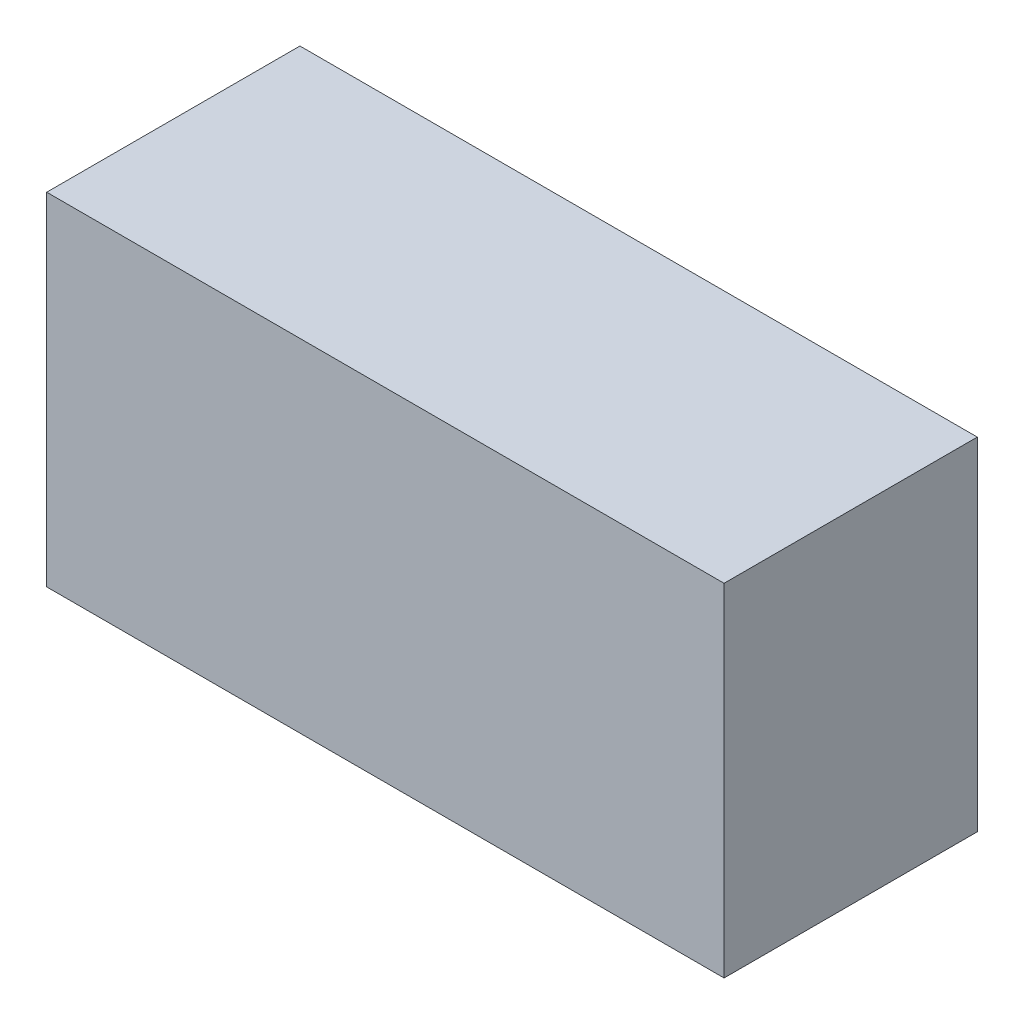
ISO-10303-21;
HEADER;
FILE_DESCRIPTION(('STEP AP214'),'2;1');
FILE_NAME('part.step','',(''),(''),'','','');
FILE_SCHEMA(('AUTOMOTIVE_DESIGN { 1 0 10303 214 1 1 1 1 }'));
ENDSEC;
DATA;
#1=APPLICATION_CONTEXT('core data for automotive mechanical design processes');
#2=APPLICATION_PROTOCOL_DEFINITION('international standard','automotive_design',2000,#1);
#3=PRODUCT_CONTEXT('',#1,'mechanical');
#4=PRODUCT('Part','Part','',(#3));
#5=PRODUCT_RELATED_PRODUCT_CATEGORY('part','',(#4));
#6=PRODUCT_DEFINITION_FORMATION('','',#4);
#7=PRODUCT_DEFINITION_CONTEXT('part definition',#1,'design');
#8=PRODUCT_DEFINITION('design','',#6,#7);
#9=PRODUCT_DEFINITION_SHAPE('','',#8);
#10=(LENGTH_UNIT() NAMED_UNIT(*) SI_UNIT(.MILLI.,.METRE.));
#11=(NAMED_UNIT(*) PLANE_ANGLE_UNIT() SI_UNIT($,.RADIAN.));
#12=(NAMED_UNIT(*) SI_UNIT($,.STERADIAN.) SOLID_ANGLE_UNIT());
#13=UNCERTAINTY_MEASURE_WITH_UNIT(LENGTH_MEASURE(1.E-05),#10,'distance_accuracy_value','');
#14=(GEOMETRIC_REPRESENTATION_CONTEXT(3) GLOBAL_UNCERTAINTY_ASSIGNED_CONTEXT((#13)) GLOBAL_UNIT_ASSIGNED_CONTEXT((#10,
#11,#12)) REPRESENTATION_CONTEXT('',''));
#15=CARTESIAN_POINT('',(0.,0.,0.));
#16=DIRECTION('',(0.,0.,1.));
#17=DIRECTION('',(1.,0.,0.));
#18=AXIS2_PLACEMENT_3D('',#15,#16,#17);
#19=CARTESIAN_POINT('',(-1.3375005,0.67499992,1.00000054));
#20=DIRECTION('',(0.,0.,-1.));
#21=DIRECTION('',(-1.,0.,0.));
#22=AXIS2_PLACEMENT_3D('',#19,#20,#21);
#23=PLANE('',#22);
#24=DIRECTION('',(1.,0.,0.));
#25=VECTOR('',#24,1.);
#26=CARTESIAN_POINT('',(-1.3375005,-0.67499992,1.00000054));
#27=LINE('',#26,#25);
#28=CARTESIAN_POINT('',(-1.3375005,-0.67499992,1.00000054));
#29=VERTEX_POINT('',#28);
#30=CARTESIAN_POINT('',(1.3375005,-0.67499992,1.00000054));
#31=VERTEX_POINT('',#30);
#32=EDGE_CURVE('E55',#29,#31,#27,.T.);
#33=ORIENTED_EDGE('',*,*,#32,.T.);
#34=DIRECTION('',(0.,1.,0.));
#35=VECTOR('',#34,1.);
#36=CARTESIAN_POINT('',(1.3375005,-0.67499992,1.00000054));
#37=LINE('',#36,#35);
#38=CARTESIAN_POINT('',(1.3375005,0.67499992,1.00000054));
#39=VERTEX_POINT('',#38);
#40=EDGE_CURVE('E58',#31,#39,#37,.T.);
#41=ORIENTED_EDGE('',*,*,#40,.T.);
#42=DIRECTION('',(1.,0.,0.));
#43=VECTOR('',#42,1.);
#44=CARTESIAN_POINT('',(1.3375005,0.67499992,1.00000054));
#45=LINE('',#44,#43);
#46=CARTESIAN_POINT('',(-1.3375005,0.67499992,1.00000054));
#47=VERTEX_POINT('',#46);
#48=EDGE_CURVE('E60',#39,#47,#45,.F.);
#49=ORIENTED_EDGE('',*,*,#48,.T.);
#50=DIRECTION('',(0.,1.,0.));
#51=VECTOR('',#50,1.);
#52=CARTESIAN_POINT('',(-1.3375005,0.67499992,1.00000054));
#53=LINE('',#52,#51);
#54=EDGE_CURVE('E20',#29,#47,#53,.T.);
#55=ORIENTED_EDGE('',*,*,#54,.F.);
#56=EDGE_LOOP('',(#33,#41,#49,#55));
#57=FACE_BOUND('',#56,.T.);
#58=ADVANCED_FACE('F17',(#57),#23,.F.);
#59=CARTESIAN_POINT('',(1.3375005,0.67499992,0.));
#60=DIRECTION('',(0.,-1.,0.));
#61=DIRECTION('',(0.,0.,-1.));
#62=AXIS2_PLACEMENT_3D('',#59,#60,#61);
#63=PLANE('',#62);
#64=DIRECTION('',(0.,0.,-1.));
#65=VECTOR('',#64,1.);
#66=CARTESIAN_POINT('',(-1.3375005,0.67499992,0.));
#67=LINE('',#66,#65);
#68=CARTESIAN_POINT('',(-1.3375005,0.67499992,0.));
#69=VERTEX_POINT('',#68);
#70=EDGE_CURVE('E71',#69,#47,#67,.F.);
#71=ORIENTED_EDGE('',*,*,#70,.T.);
#72=ORIENTED_EDGE('',*,*,#48,.F.);
#73=DIRECTION('',(0.,0.,1.));
#74=VECTOR('',#73,1.);
#75=CARTESIAN_POINT('',(1.3375005,0.67499992,0.));
#76=LINE('',#75,#74);
#77=CARTESIAN_POINT('',(1.3375005,0.67499992,0.));
#78=VERTEX_POINT('',#77);
#79=EDGE_CURVE('E65',#39,#78,#76,.F.);
#80=ORIENTED_EDGE('',*,*,#79,.T.);
#81=DIRECTION('',(-1.,0.,0.));
#82=VECTOR('',#81,1.);
#83=CARTESIAN_POINT('',(-1.3375005,0.67499992,0.));
#84=LINE('',#83,#82);
#85=EDGE_CURVE('E83',#69,#78,#84,.F.);
#86=ORIENTED_EDGE('',*,*,#85,.F.);
#87=EDGE_LOOP('',(#71,#72,#80,#86));
#88=FACE_BOUND('',#87,.T.);
#89=ADVANCED_FACE('F68',(#88),#63,.F.);
#90=CARTESIAN_POINT('',(1.3375005,-0.67499992,0.));
#91=DIRECTION('',(-1.,0.,0.));
#92=DIRECTION('',(0.,0.,1.));
#93=AXIS2_PLACEMENT_3D('',#90,#91,#92);
#94=PLANE('',#93);
#95=ORIENTED_EDGE('',*,*,#79,.F.);
#96=ORIENTED_EDGE('',*,*,#40,.F.);
#97=DIRECTION('',(0.,0.,1.));
#98=VECTOR('',#97,1.);
#99=CARTESIAN_POINT('',(1.3375005,-0.67499992,0.));
#100=LINE('',#99,#98);
#101=CARTESIAN_POINT('',(1.3375005,-0.67499992,0.));
#102=VERTEX_POINT('',#101);
#103=EDGE_CURVE('E77',#31,#102,#100,.F.);
#104=ORIENTED_EDGE('',*,*,#103,.T.);
#105=DIRECTION('',(0.,1.,0.));
#106=VECTOR('',#105,1.);
#107=CARTESIAN_POINT('',(1.3375005,0.67499992,0.));
#108=LINE('',#107,#106);
#109=EDGE_CURVE('E74',#78,#102,#108,.F.);
#110=ORIENTED_EDGE('',*,*,#109,.F.);
#111=EDGE_LOOP('',(#95,#96,#104,#110));
#112=FACE_BOUND('',#111,.T.);
#113=ADVANCED_FACE('F72',(#112),#94,.F.);
#114=CARTESIAN_POINT('',(-1.3375005,-0.67499992,0.));
#115=DIRECTION('',(0.,1.,0.));
#116=DIRECTION('',(0.,0.,1.));
#117=AXIS2_PLACEMENT_3D('',#114,#115,#116);
#118=PLANE('',#117);
#119=ORIENTED_EDGE('',*,*,#103,.F.);
#120=ORIENTED_EDGE('',*,*,#32,.F.);
#121=DIRECTION('',(0.,0.,-1.));
#122=VECTOR('',#121,1.);
#123=CARTESIAN_POINT('',(-1.3375005,-0.67499992,0.));
#124=LINE('',#123,#122);
#125=CARTESIAN_POINT('',(-1.3375005,-0.67499992,0.));
#126=VERTEX_POINT('',#125);
#127=EDGE_CURVE('E35',#29,#126,#124,.T.);
#128=ORIENTED_EDGE('',*,*,#127,.T.);
#129=DIRECTION('',(-1.,0.,0.));
#130=VECTOR('',#129,1.);
#131=CARTESIAN_POINT('',(-1.3375005,-0.67499992,0.));
#132=LINE('',#131,#130);
#133=EDGE_CURVE('E26',#102,#126,#132,.T.);
#134=ORIENTED_EDGE('',*,*,#133,.F.);
#135=EDGE_LOOP('',(#119,#120,#128,#134));
#136=FACE_BOUND('',#135,.T.);
#137=ADVANCED_FACE('F89',(#136),#118,.F.);
#138=CARTESIAN_POINT('',(-1.3375005,0.67499992,0.));
#139=DIRECTION('',(1.,0.,0.));
#140=DIRECTION('',(0.,0.,-1.));
#141=AXIS2_PLACEMENT_3D('',#138,#139,#140);
#142=PLANE('',#141);
#143=ORIENTED_EDGE('',*,*,#127,.F.);
#144=ORIENTED_EDGE('',*,*,#54,.T.);
#145=ORIENTED_EDGE('',*,*,#70,.F.);
#146=DIRECTION('',(0.,1.,0.));
#147=VECTOR('',#146,1.);
#148=CARTESIAN_POINT('',(-1.3375005,0.67499992,0.));
#149=LINE('',#148,#147);
#150=EDGE_CURVE('E11',#126,#69,#149,.T.);
#151=ORIENTED_EDGE('',*,*,#150,.F.);
#152=EDGE_LOOP('',(#143,#144,#145,#151));
#153=FACE_BOUND('',#152,.T.);
#154=ADVANCED_FACE('F91',(#153),#142,.F.);
#155=CARTESIAN_POINT('',(-1.3375005,0.67499992,0.));
#156=DIRECTION('',(0.,0.,-1.));
#157=DIRECTION('',(-1.,0.,0.));
#158=AXIS2_PLACEMENT_3D('',#155,#156,#157);
#159=PLANE('',#158);
#160=ORIENTED_EDGE('',*,*,#133,.T.);
#161=ORIENTED_EDGE('',*,*,#150,.T.);
#162=ORIENTED_EDGE('',*,*,#85,.T.);
#163=ORIENTED_EDGE('',*,*,#109,.T.);
#164=EDGE_LOOP('',(#160,#161,#162,#163));
#165=FACE_BOUND('',#164,.T.);
#166=ADVANCED_FACE('F88',(#165),#159,.T.);
#167=CLOSED_SHELL('',(#58,#89,#113,#137,#154,#166));
#168=MANIFOLD_SOLID_BREP('B1',#167);
#169=ADVANCED_BREP_SHAPE_REPRESENTATION('',(#18,#168),#14);
#170=SHAPE_DEFINITION_REPRESENTATION(#9,#169);
ENDSEC;
END-ISO-10303-21;
